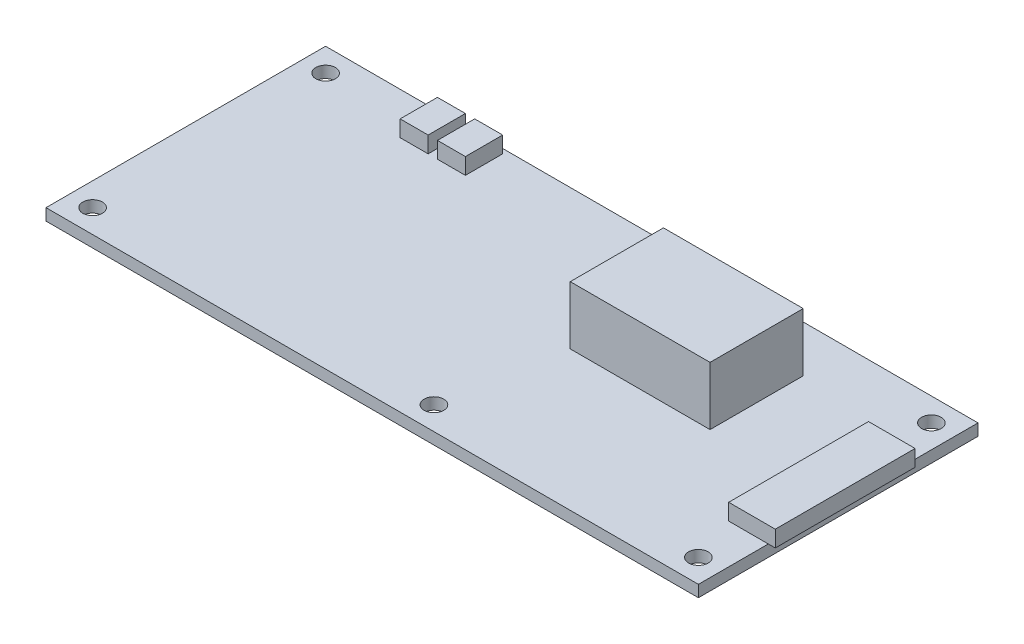
ISO-10303-21;
HEADER;
FILE_DESCRIPTION(('STEP AP214'),'2;1');
FILE_NAME('part.step','',(''),(''),'','','');
FILE_SCHEMA(('AUTOMOTIVE_DESIGN { 1 0 10303 214 1 1 1 1 }'));
ENDSEC;
DATA;
#1=APPLICATION_CONTEXT('core data for automotive mechanical design processes');
#2=APPLICATION_PROTOCOL_DEFINITION('international standard','automotive_design',2000,#1);
#3=PRODUCT_CONTEXT('',#1,'mechanical');
#4=PRODUCT('Part','Part','',(#3));
#5=PRODUCT_RELATED_PRODUCT_CATEGORY('part','',(#4));
#6=PRODUCT_DEFINITION_FORMATION('','',#4);
#7=PRODUCT_DEFINITION_CONTEXT('part definition',#1,'design');
#8=PRODUCT_DEFINITION('design','',#6,#7);
#9=PRODUCT_DEFINITION_SHAPE('','',#8);
#10=(LENGTH_UNIT() NAMED_UNIT(*) SI_UNIT(.MILLI.,.METRE.));
#11=(NAMED_UNIT(*) PLANE_ANGLE_UNIT() SI_UNIT($,.RADIAN.));
#12=(NAMED_UNIT(*) SI_UNIT($,.STERADIAN.) SOLID_ANGLE_UNIT());
#13=UNCERTAINTY_MEASURE_WITH_UNIT(LENGTH_MEASURE(1.E-05),#10,'distance_accuracy_value','');
#14=(GEOMETRIC_REPRESENTATION_CONTEXT(3) GLOBAL_UNCERTAINTY_ASSIGNED_CONTEXT((#13)) GLOBAL_UNIT_ASSIGNED_CONTEXT((#10,
#11,#12)) REPRESENTATION_CONTEXT('',''));
#15=CARTESIAN_POINT('',(0.,0.,0.));
#16=DIRECTION('',(0.,0.,1.));
#17=DIRECTION('',(1.,0.,0.));
#18=AXIS2_PLACEMENT_3D('',#15,#16,#17);
#19=CARTESIAN_POINT('',(0.,2.5,0.));
#20=DIRECTION('',(0.,1.,0.));
#21=DIRECTION('',(0.,0.,1.));
#22=AXIS2_PLACEMENT_3D('',#19,#20,#21);
#23=PLANE('',#22);
#24=CARTESIAN_POINT('',(8.24999999999998,2.5,25.));
#25=DIRECTION('',(0.,1.,0.));
#26=DIRECTION('',(0.,0.,1.));
#27=AXIS2_PLACEMENT_3D('',#24,#25,#26);
#28=CIRCLE('',#27,2.1);
#29=CARTESIAN_POINT('',(8.24999999999998,2.5,27.1));
#30=VERTEX_POINT('',#29);
#31=EDGE_CURVE('E302',#30,#30,#28,.T.);
#32=ORIENTED_EDGE('',*,*,#31,.F.);
#33=EDGE_LOOP('',(#32));
#34=FACE_BOUND('',#33,.T.);
#35=CARTESIAN_POINT('',(65.,2.5,-25.));
#36=DIRECTION('',(0.,1.,0.));
#37=DIRECTION('',(0.,0.,1.));
#38=AXIS2_PLACEMENT_3D('',#35,#36,#37);
#39=CIRCLE('',#38,2.1);
#40=CARTESIAN_POINT('',(65.,2.5,-22.9));
#41=VERTEX_POINT('',#40);
#42=EDGE_CURVE('E314',#41,#41,#39,.T.);
#43=ORIENTED_EDGE('',*,*,#42,.F.);
#44=EDGE_LOOP('',(#43));
#45=FACE_BOUND('',#44,.T.);
#46=CARTESIAN_POINT('',(-65.,2.5,-25.));
#47=DIRECTION('',(0.,1.,0.));
#48=DIRECTION('',(0.,0.,1.));
#49=AXIS2_PLACEMENT_3D('',#46,#47,#48);
#50=CIRCLE('',#49,2.1);
#51=CARTESIAN_POINT('',(-65.,2.5,-22.9));
#52=VERTEX_POINT('',#51);
#53=EDGE_CURVE('E326',#52,#52,#50,.T.);
#54=ORIENTED_EDGE('',*,*,#53,.F.);
#55=EDGE_LOOP('',(#54));
#56=FACE_BOUND('',#55,.T.);
#57=CARTESIAN_POINT('',(8.24999999999998,2.5,-25.));
#58=DIRECTION('',(0.,1.,0.));
#59=DIRECTION('',(0.,0.,1.));
#60=AXIS2_PLACEMENT_3D('',#57,#58,#59);
#61=CIRCLE('',#60,2.1);
#62=CARTESIAN_POINT('',(8.24999999999998,2.5,-22.9));
#63=VERTEX_POINT('',#62);
#64=EDGE_CURVE('E320',#63,#63,#61,.T.);
#65=ORIENTED_EDGE('',*,*,#64,.F.);
#66=EDGE_LOOP('',(#65));
#67=FACE_BOUND('',#66,.T.);
#68=CARTESIAN_POINT('',(-65.,2.5,25.));
#69=DIRECTION('',(0.,1.,0.));
#70=DIRECTION('',(0.,0.,1.));
#71=AXIS2_PLACEMENT_3D('',#68,#69,#70);
#72=CIRCLE('',#71,2.1);
#73=CARTESIAN_POINT('',(-65.,2.5,27.1));
#74=VERTEX_POINT('',#73);
#75=EDGE_CURVE('E308',#74,#74,#72,.T.);
#76=ORIENTED_EDGE('',*,*,#75,.F.);
#77=EDGE_LOOP('',(#76));
#78=FACE_BOUND('',#77,.T.);
#79=CARTESIAN_POINT('',(65.,2.5,25.));
#80=DIRECTION('',(0.,1.,0.));
#81=DIRECTION('',(0.,0.,1.));
#82=AXIS2_PLACEMENT_3D('',#79,#80,#81);
#83=CIRCLE('',#82,2.1);
#84=CARTESIAN_POINT('',(65.,2.5,27.1));
#85=VERTEX_POINT('',#84);
#86=EDGE_CURVE('E296',#85,#85,#83,.T.);
#87=ORIENTED_EDGE('',*,*,#86,.F.);
#88=EDGE_LOOP('',(#87));
#89=FACE_BOUND('',#88,.T.);
#90=DIRECTION('',(1.,0.,0.));
#91=VECTOR('',#90,1.);
#92=CARTESIAN_POINT('',(-45.,2.5,-21.));
#93=LINE('',#92,#91);
#94=CARTESIAN_POINT('',(-45.,2.5,-21.));
#95=VERTEX_POINT('',#94);
#96=CARTESIAN_POINT('',(-39.,2.5,-21.));
#97=VERTEX_POINT('',#96);
#98=EDGE_CURVE('E280',#95,#97,#93,.T.);
#99=ORIENTED_EDGE('',*,*,#98,.F.);
#100=DIRECTION('',(0.,0.,1.));
#101=VECTOR('',#100,1.);
#102=CARTESIAN_POINT('',(-45.,2.5,-29.));
#103=LINE('',#102,#101);
#104=CARTESIAN_POINT('',(-45.,2.5,-29.));
#105=VERTEX_POINT('',#104);
#106=EDGE_CURVE('E266',#105,#95,#103,.T.);
#107=ORIENTED_EDGE('',*,*,#106,.F.);
#108=DIRECTION('',(-1.,0.,0.));
#109=VECTOR('',#108,1.);
#110=CARTESIAN_POINT('',(-45.,2.5,-29.));
#111=LINE('',#110,#109);
#112=CARTESIAN_POINT('',(-39.,2.5,-29.));
#113=VERTEX_POINT('',#112);
#114=EDGE_CURVE('E271',#113,#105,#111,.T.);
#115=ORIENTED_EDGE('',*,*,#114,.F.);
#116=DIRECTION('',(0.,0.,-1.));
#117=VECTOR('',#116,1.);
#118=CARTESIAN_POINT('',(-39.,2.5,-29.));
#119=LINE('',#118,#117);
#120=EDGE_CURVE('E282',#97,#113,#119,.T.);
#121=ORIENTED_EDGE('',*,*,#120,.F.);
#122=EDGE_LOOP('',(#99,#107,#115,#121));
#123=FACE_BOUND('',#122,.T.);
#124=DIRECTION('',(1.,0.,0.));
#125=VECTOR('',#124,1.);
#126=CARTESIAN_POINT('',(-37.,2.5,-21.));
#127=LINE('',#126,#125);
#128=CARTESIAN_POINT('',(-37.,2.5,-21.));
#129=VERTEX_POINT('',#128);
#130=CARTESIAN_POINT('',(-31.,2.5,-21.));
#131=VERTEX_POINT('',#130);
#132=EDGE_CURVE('E251',#129,#131,#127,.T.);
#133=ORIENTED_EDGE('',*,*,#132,.F.);
#134=DIRECTION('',(0.,0.,1.));
#135=VECTOR('',#134,1.);
#136=CARTESIAN_POINT('',(-37.,2.5,-29.));
#137=LINE('',#136,#135);
#138=CARTESIAN_POINT('',(-37.,2.5,-29.));
#139=VERTEX_POINT('',#138);
#140=EDGE_CURVE('E237',#139,#129,#137,.T.);
#141=ORIENTED_EDGE('',*,*,#140,.F.);
#142=DIRECTION('',(-1.,0.,0.));
#143=VECTOR('',#142,1.);
#144=CARTESIAN_POINT('',(-37.,2.5,-29.));
#145=LINE('',#144,#143);
#146=CARTESIAN_POINT('',(-31.,2.5,-29.));
#147=VERTEX_POINT('',#146);
#148=EDGE_CURVE('E242',#147,#139,#145,.T.);
#149=ORIENTED_EDGE('',*,*,#148,.F.);
#150=DIRECTION('',(0.,0.,-1.));
#151=VECTOR('',#150,1.);
#152=CARTESIAN_POINT('',(-31.,2.5,-29.));
#153=LINE('',#152,#151);
#154=EDGE_CURVE('E253',#131,#147,#153,.T.);
#155=ORIENTED_EDGE('',*,*,#154,.F.);
#156=EDGE_LOOP('',(#133,#141,#149,#155));
#157=FACE_BOUND('',#156,.T.);
#158=DIRECTION('',(0.,0.,-1.));
#159=VECTOR('',#158,1.);
#160=CARTESIAN_POINT('',(70.,2.5,-30.));
#161=LINE('',#160,#159);
#162=CARTESIAN_POINT('',(70.,2.5,30.));
#163=VERTEX_POINT('',#162);
#164=CARTESIAN_POINT('',(70.,2.5,15.));
#165=VERTEX_POINT('',#164);
#166=EDGE_CURVE('E332',#163,#165,#161,.T.);
#167=ORIENTED_EDGE('',*,*,#166,.T.);
#168=DIRECTION('',(1.,0.,0.));
#169=VECTOR('',#168,1.);
#170=CARTESIAN_POINT('',(61.5,2.5,15.));
#171=LINE('',#170,#169);
#172=CARTESIAN_POINT('',(61.5,2.5,15.));
#173=VERTEX_POINT('',#172);
#174=EDGE_CURVE('E56',#173,#165,#171,.T.);
#175=ORIENTED_EDGE('',*,*,#174,.F.);
#176=DIRECTION('',(0.,0.,1.));
#177=VECTOR('',#176,1.);
#178=CARTESIAN_POINT('',(61.5,2.5,-15.));
#179=LINE('',#178,#177);
#180=CARTESIAN_POINT('',(61.5,2.5,-15.));
#181=VERTEX_POINT('',#180);
#182=EDGE_CURVE('E202',#181,#173,#179,.T.);
#183=ORIENTED_EDGE('',*,*,#182,.F.);
#184=DIRECTION('',(-1.,0.,0.));
#185=VECTOR('',#184,1.);
#186=CARTESIAN_POINT('',(61.5,2.5,-15.));
#187=LINE('',#186,#185);
#188=CARTESIAN_POINT('',(70.,2.5,-15.));
#189=VERTEX_POINT('',#188);
#190=EDGE_CURVE('E224',#189,#181,#187,.T.);
#191=ORIENTED_EDGE('',*,*,#190,.F.);
#192=CARTESIAN_POINT('',(70.,2.5,-30.));
#193=VERTEX_POINT('',#192);
#194=EDGE_CURVE('E336',#189,#193,#161,.T.);
#195=ORIENTED_EDGE('',*,*,#194,.T.);
#196=DIRECTION('',(-1.,0.,0.));
#197=VECTOR('',#196,1.);
#198=CARTESIAN_POINT('',(-70.,2.5,-30.));
#199=LINE('',#198,#197);
#200=CARTESIAN_POINT('',(-70.,2.5,-30.));
#201=VERTEX_POINT('',#200);
#202=EDGE_CURVE('E334',#193,#201,#199,.T.);
#203=ORIENTED_EDGE('',*,*,#202,.T.);
#204=DIRECTION('',(0.,0.,1.));
#205=VECTOR('',#204,1.);
#206=CARTESIAN_POINT('',(-70.,2.5,-30.));
#207=LINE('',#206,#205);
#208=CARTESIAN_POINT('',(-70.,2.5,30.));
#209=VERTEX_POINT('',#208);
#210=EDGE_CURVE('E338',#201,#209,#207,.T.);
#211=ORIENTED_EDGE('',*,*,#210,.T.);
#212=DIRECTION('',(1.,0.,0.));
#213=VECTOR('',#212,1.);
#214=CARTESIAN_POINT('',(-70.,2.5,30.));
#215=LINE('',#214,#213);
#216=EDGE_CURVE('E340',#209,#163,#215,.T.);
#217=ORIENTED_EDGE('',*,*,#216,.T.);
#218=EDGE_LOOP('',(#167,#175,#183,#191,#195,#203,#211,#217));
#219=FACE_BOUND('',#218,.T.);
#220=DIRECTION('',(1.,0.,0.));
#221=VECTOR('',#220,1.);
#222=CARTESIAN_POINT('',(12.5,2.5,0.));
#223=LINE('',#222,#221);
#224=CARTESIAN_POINT('',(12.5,2.5,0.));
#225=VERTEX_POINT('',#224);
#226=CARTESIAN_POINT('',(42.5,2.5,0.));
#227=VERTEX_POINT('',#226);
#228=EDGE_CURVE('E679',#225,#227,#223,.T.);
#229=ORIENTED_EDGE('',*,*,#228,.F.);
#230=DIRECTION('',(0.,0.,1.));
#231=VECTOR('',#230,1.);
#232=CARTESIAN_POINT('',(12.5,2.5,-20.));
#233=LINE('',#232,#231);
#234=CARTESIAN_POINT('',(12.5,2.5,-20.));
#235=VERTEX_POINT('',#234);
#236=EDGE_CURVE('E200',#235,#225,#233,.T.);
#237=ORIENTED_EDGE('',*,*,#236,.F.);
#238=DIRECTION('',(-1.,0.,0.));
#239=VECTOR('',#238,1.);
#240=CARTESIAN_POINT('',(12.5,2.5,-20.));
#241=LINE('',#240,#239);
#242=CARTESIAN_POINT('',(42.5,2.5,-20.));
#243=VERTEX_POINT('',#242);
#244=EDGE_CURVE('E196',#243,#235,#241,.T.);
#245=ORIENTED_EDGE('',*,*,#244,.F.);
#246=DIRECTION('',(0.,0.,-1.));
#247=VECTOR('',#246,1.);
#248=CARTESIAN_POINT('',(42.5,2.5,-20.));
#249=LINE('',#248,#247);
#250=EDGE_CURVE('E676',#227,#243,#249,.T.);
#251=ORIENTED_EDGE('',*,*,#250,.F.);
#252=EDGE_LOOP('',(#229,#237,#245,#251));
#253=FACE_BOUND('',#252,.T.);
#254=ADVANCED_FACE('F33',(#34,#45,#56,#67,#78,#89,#123,#157,#219,#253),#23,.T.);
#255=CARTESIAN_POINT('',(0.,0.,0.));
#256=DIRECTION('',(0.,1.,0.));
#257=DIRECTION('',(0.,0.,1.));
#258=AXIS2_PLACEMENT_3D('',#255,#256,#257);
#259=PLANE('',#258);
#260=DIRECTION('',(0.,0.,-1.));
#261=VECTOR('',#260,1.);
#262=CARTESIAN_POINT('',(70.,0.,-30.));
#263=LINE('',#262,#261);
#264=CARTESIAN_POINT('',(70.,0.,30.));
#265=VERTEX_POINT('',#264);
#266=CARTESIAN_POINT('',(70.,0.,-30.));
#267=VERTEX_POINT('',#266);
#268=EDGE_CURVE('E329',#265,#267,#263,.T.);
#269=ORIENTED_EDGE('',*,*,#268,.F.);
#270=DIRECTION('',(1.,0.,0.));
#271=VECTOR('',#270,1.);
#272=CARTESIAN_POINT('',(-70.,0.,30.));
#273=LINE('',#272,#271);
#274=CARTESIAN_POINT('',(-70.,0.,30.));
#275=VERTEX_POINT('',#274);
#276=EDGE_CURVE('E349',#275,#265,#273,.T.);
#277=ORIENTED_EDGE('',*,*,#276,.F.);
#278=DIRECTION('',(0.,0.,1.));
#279=VECTOR('',#278,1.);
#280=CARTESIAN_POINT('',(-70.,0.,-30.));
#281=LINE('',#280,#279);
#282=CARTESIAN_POINT('',(-70.,0.,-30.));
#283=VERTEX_POINT('',#282);
#284=EDGE_CURVE('E347',#283,#275,#281,.T.);
#285=ORIENTED_EDGE('',*,*,#284,.F.);
#286=DIRECTION('',(-1.,0.,0.));
#287=VECTOR('',#286,1.);
#288=CARTESIAN_POINT('',(-70.,0.,-30.));
#289=LINE('',#288,#287);
#290=EDGE_CURVE('E345',#267,#283,#289,.T.);
#291=ORIENTED_EDGE('',*,*,#290,.F.);
#292=EDGE_LOOP('',(#269,#277,#285,#291));
#293=FACE_BOUND('',#292,.T.);
#294=CARTESIAN_POINT('',(-65.,0.,-25.));
#295=DIRECTION('',(0.,1.,0.));
#296=DIRECTION('',(0.,0.,1.));
#297=AXIS2_PLACEMENT_3D('',#294,#295,#296);
#298=CIRCLE('',#297,2.1);
#299=CARTESIAN_POINT('',(-65.,0.,-22.9));
#300=VERTEX_POINT('',#299);
#301=EDGE_CURVE('E323',#300,#300,#298,.T.);
#302=ORIENTED_EDGE('',*,*,#301,.T.);
#303=EDGE_LOOP('',(#302));
#304=FACE_BOUND('',#303,.T.);
#305=CARTESIAN_POINT('',(8.24999999999998,0.,-25.));
#306=DIRECTION('',(0.,1.,0.));
#307=DIRECTION('',(0.,0.,1.));
#308=AXIS2_PLACEMENT_3D('',#305,#306,#307);
#309=CIRCLE('',#308,2.1);
#310=CARTESIAN_POINT('',(8.24999999999998,0.,-22.9));
#311=VERTEX_POINT('',#310);
#312=EDGE_CURVE('E317',#311,#311,#309,.T.);
#313=ORIENTED_EDGE('',*,*,#312,.T.);
#314=EDGE_LOOP('',(#313));
#315=FACE_BOUND('',#314,.T.);
#316=CARTESIAN_POINT('',(65.,0.,-25.));
#317=DIRECTION('',(0.,1.,0.));
#318=DIRECTION('',(0.,0.,1.));
#319=AXIS2_PLACEMENT_3D('',#316,#317,#318);
#320=CIRCLE('',#319,2.1);
#321=CARTESIAN_POINT('',(65.,0.,-22.9));
#322=VERTEX_POINT('',#321);
#323=EDGE_CURVE('E311',#322,#322,#320,.T.);
#324=ORIENTED_EDGE('',*,*,#323,.T.);
#325=EDGE_LOOP('',(#324));
#326=FACE_BOUND('',#325,.T.);
#327=CARTESIAN_POINT('',(-65.,0.,25.));
#328=DIRECTION('',(0.,1.,0.));
#329=DIRECTION('',(0.,0.,1.));
#330=AXIS2_PLACEMENT_3D('',#327,#328,#329);
#331=CIRCLE('',#330,2.1);
#332=CARTESIAN_POINT('',(-65.,0.,27.1));
#333=VERTEX_POINT('',#332);
#334=EDGE_CURVE('E305',#333,#333,#331,.T.);
#335=ORIENTED_EDGE('',*,*,#334,.T.);
#336=EDGE_LOOP('',(#335));
#337=FACE_BOUND('',#336,.T.);
#338=CARTESIAN_POINT('',(8.24999999999998,0.,25.));
#339=DIRECTION('',(0.,1.,0.));
#340=DIRECTION('',(0.,0.,1.));
#341=AXIS2_PLACEMENT_3D('',#338,#339,#340);
#342=CIRCLE('',#341,2.1);
#343=CARTESIAN_POINT('',(8.24999999999998,0.,27.1));
#344=VERTEX_POINT('',#343);
#345=EDGE_CURVE('E299',#344,#344,#342,.T.);
#346=ORIENTED_EDGE('',*,*,#345,.T.);
#347=EDGE_LOOP('',(#346));
#348=FACE_BOUND('',#347,.T.);
#349=CARTESIAN_POINT('',(65.,0.,25.));
#350=DIRECTION('',(0.,1.,0.));
#351=DIRECTION('',(0.,0.,1.));
#352=AXIS2_PLACEMENT_3D('',#349,#350,#351);
#353=CIRCLE('',#352,2.1);
#354=CARTESIAN_POINT('',(65.,0.,27.1));
#355=VERTEX_POINT('',#354);
#356=EDGE_CURVE('E295',#355,#355,#353,.T.);
#357=ORIENTED_EDGE('',*,*,#356,.T.);
#358=EDGE_LOOP('',(#357));
#359=FACE_BOUND('',#358,.T.);
#360=ADVANCED_FACE('F367',(#293,#304,#315,#326,#337,#348,#359),#259,.F.);
#361=CARTESIAN_POINT('',(70.,2.5,-30.));
#362=DIRECTION('',(-1.,0.,0.));
#363=DIRECTION('',(0.,0.,1.));
#364=AXIS2_PLACEMENT_3D('',#361,#362,#363);
#365=PLANE('',#364);
#366=ORIENTED_EDGE('',*,*,#268,.T.);
#367=DIRECTION('',(0.,-1.,0.));
#368=VECTOR('',#367,1.);
#369=CARTESIAN_POINT('',(70.,2.5,-30.));
#370=LINE('',#369,#368);
#371=EDGE_CURVE('E11',#193,#267,#370,.T.);
#372=ORIENTED_EDGE('',*,*,#371,.F.);
#373=ORIENTED_EDGE('',*,*,#194,.F.);
#374=EDGE_CURVE('E335',#165,#189,#161,.T.);
#375=ORIENTED_EDGE('',*,*,#374,.F.);
#376=ORIENTED_EDGE('',*,*,#166,.F.);
#377=DIRECTION('',(0.,-1.,0.));
#378=VECTOR('',#377,1.);
#379=CARTESIAN_POINT('',(70.,2.5,30.));
#380=LINE('',#379,#378);
#381=EDGE_CURVE('E342',#163,#265,#380,.T.);
#382=ORIENTED_EDGE('',*,*,#381,.T.);
#383=EDGE_LOOP('',(#366,#372,#373,#375,#376,#382));
#384=FACE_BOUND('',#383,.T.);
#385=ADVANCED_FACE('F35',(#384),#365,.F.);
#386=CARTESIAN_POINT('',(-70.,2.5,-30.));
#387=DIRECTION('',(0.,0.,1.));
#388=DIRECTION('',(1.,0.,0.));
#389=AXIS2_PLACEMENT_3D('',#386,#387,#388);
#390=PLANE('',#389);
#391=ORIENTED_EDGE('',*,*,#290,.T.);
#392=DIRECTION('',(0.,-1.,0.));
#393=VECTOR('',#392,1.);
#394=CARTESIAN_POINT('',(-70.,2.5,-30.));
#395=LINE('',#394,#393);
#396=EDGE_CURVE('E41',#201,#283,#395,.T.);
#397=ORIENTED_EDGE('',*,*,#396,.F.);
#398=ORIENTED_EDGE('',*,*,#202,.F.);
#399=ORIENTED_EDGE('',*,*,#371,.T.);
#400=EDGE_LOOP('',(#391,#397,#398,#399));
#401=FACE_BOUND('',#400,.T.);
#402=ADVANCED_FACE('F427',(#401),#390,.F.);
#403=CARTESIAN_POINT('',(-70.,2.5,-30.));
#404=DIRECTION('',(1.,0.,0.));
#405=DIRECTION('',(0.,0.,-1.));
#406=AXIS2_PLACEMENT_3D('',#403,#404,#405);
#407=PLANE('',#406);
#408=ORIENTED_EDGE('',*,*,#284,.T.);
#409=DIRECTION('',(0.,-1.,0.));
#410=VECTOR('',#409,1.);
#411=CARTESIAN_POINT('',(-70.,2.5,30.));
#412=LINE('',#411,#410);
#413=EDGE_CURVE('E353',#209,#275,#412,.T.);
#414=ORIENTED_EDGE('',*,*,#413,.F.);
#415=ORIENTED_EDGE('',*,*,#210,.F.);
#416=ORIENTED_EDGE('',*,*,#396,.T.);
#417=EDGE_LOOP('',(#408,#414,#415,#416));
#418=FACE_BOUND('',#417,.T.);
#419=ADVANCED_FACE('F360',(#418),#407,.F.);
#420=CARTESIAN_POINT('',(-70.,2.5,30.));
#421=DIRECTION('',(0.,0.,-1.));
#422=DIRECTION('',(-1.,0.,0.));
#423=AXIS2_PLACEMENT_3D('',#420,#421,#422);
#424=PLANE('',#423);
#425=ORIENTED_EDGE('',*,*,#276,.T.);
#426=ORIENTED_EDGE('',*,*,#381,.F.);
#427=ORIENTED_EDGE('',*,*,#216,.F.);
#428=ORIENTED_EDGE('',*,*,#413,.T.);
#429=EDGE_LOOP('',(#425,#426,#427,#428));
#430=FACE_BOUND('',#429,.T.);
#431=ADVANCED_FACE('F371',(#430),#424,.F.);
#432=CARTESIAN_POINT('',(-65.,2.5,-25.));
#433=DIRECTION('',(0.,-1.,0.));
#434=DIRECTION('',(0.,0.,-1.));
#435=AXIS2_PLACEMENT_3D('',#432,#433,#434);
#436=CYLINDRICAL_SURFACE('',#435,2.1);
#437=ORIENTED_EDGE('',*,*,#53,.T.);
#438=EDGE_LOOP('',(#437));
#439=FACE_BOUND('',#438,.T.);
#440=ORIENTED_EDGE('',*,*,#301,.F.);
#441=EDGE_LOOP('',(#440));
#442=FACE_BOUND('',#441,.T.);
#443=ADVANCED_FACE('F421',(#439,#442),#436,.F.);
#444=CARTESIAN_POINT('',(8.24999999999998,2.5,-25.));
#445=DIRECTION('',(0.,-1.,0.));
#446=DIRECTION('',(0.,0.,-1.));
#447=AXIS2_PLACEMENT_3D('',#444,#445,#446);
#448=CYLINDRICAL_SURFACE('',#447,2.1);
#449=ORIENTED_EDGE('',*,*,#64,.T.);
#450=EDGE_LOOP('',(#449));
#451=FACE_BOUND('',#450,.T.);
#452=ORIENTED_EDGE('',*,*,#312,.F.);
#453=EDGE_LOOP('',(#452));
#454=FACE_BOUND('',#453,.T.);
#455=ADVANCED_FACE('F465',(#451,#454),#448,.F.);
#456=CARTESIAN_POINT('',(65.,2.5,-25.));
#457=DIRECTION('',(0.,-1.,0.));
#458=DIRECTION('',(0.,0.,-1.));
#459=AXIS2_PLACEMENT_3D('',#456,#457,#458);
#460=CYLINDRICAL_SURFACE('',#459,2.1);
#461=ORIENTED_EDGE('',*,*,#42,.T.);
#462=EDGE_LOOP('',(#461));
#463=FACE_BOUND('',#462,.T.);
#464=ORIENTED_EDGE('',*,*,#323,.F.);
#465=EDGE_LOOP('',(#464));
#466=FACE_BOUND('',#465,.T.);
#467=ADVANCED_FACE('F474',(#463,#466),#460,.F.);
#468=CARTESIAN_POINT('',(-65.,2.5,25.));
#469=DIRECTION('',(0.,-1.,0.));
#470=DIRECTION('',(0.,0.,-1.));
#471=AXIS2_PLACEMENT_3D('',#468,#469,#470);
#472=CYLINDRICAL_SURFACE('',#471,2.1);
#473=ORIENTED_EDGE('',*,*,#75,.T.);
#474=EDGE_LOOP('',(#473));
#475=FACE_BOUND('',#474,.T.);
#476=ORIENTED_EDGE('',*,*,#334,.F.);
#477=EDGE_LOOP('',(#476));
#478=FACE_BOUND('',#477,.T.);
#479=ADVANCED_FACE('F483',(#475,#478),#472,.F.);
#480=CARTESIAN_POINT('',(8.24999999999998,2.5,25.));
#481=DIRECTION('',(0.,-1.,0.));
#482=DIRECTION('',(0.,0.,-1.));
#483=AXIS2_PLACEMENT_3D('',#480,#481,#482);
#484=CYLINDRICAL_SURFACE('',#483,2.1);
#485=ORIENTED_EDGE('',*,*,#31,.T.);
#486=EDGE_LOOP('',(#485));
#487=FACE_BOUND('',#486,.T.);
#488=ORIENTED_EDGE('',*,*,#345,.F.);
#489=EDGE_LOOP('',(#488));
#490=FACE_BOUND('',#489,.T.);
#491=ADVANCED_FACE('F493',(#487,#490),#484,.F.);
#492=CARTESIAN_POINT('',(65.,2.5,25.));
#493=DIRECTION('',(0.,-1.,0.));
#494=DIRECTION('',(0.,0.,-1.));
#495=AXIS2_PLACEMENT_3D('',#492,#493,#494);
#496=CYLINDRICAL_SURFACE('',#495,2.1);
#497=ORIENTED_EDGE('',*,*,#86,.T.);
#498=EDGE_LOOP('',(#497));
#499=FACE_BOUND('',#498,.T.);
#500=ORIENTED_EDGE('',*,*,#356,.F.);
#501=EDGE_LOOP('',(#500));
#502=FACE_BOUND('',#501,.T.);
#503=ADVANCED_FACE('F502',(#499,#502),#496,.F.);
#504=CARTESIAN_POINT('',(-45.,6.,-29.));
#505=DIRECTION('',(1.,0.,0.));
#506=DIRECTION('',(0.,0.,-1.));
#507=AXIS2_PLACEMENT_3D('',#504,#505,#506);
#508=PLANE('',#507);
#509=ORIENTED_EDGE('',*,*,#106,.T.);
#510=DIRECTION('',(0.,-1.,0.));
#511=VECTOR('',#510,1.);
#512=CARTESIAN_POINT('',(-45.,6.,-21.));
#513=LINE('',#512,#511);
#514=CARTESIAN_POINT('',(-45.,6.,-21.));
#515=VERTEX_POINT('',#514);
#516=EDGE_CURVE('E293',#515,#95,#513,.T.);
#517=ORIENTED_EDGE('',*,*,#516,.F.);
#518=DIRECTION('',(0.,0.,1.));
#519=VECTOR('',#518,1.);
#520=CARTESIAN_POINT('',(-45.,6.,-29.));
#521=LINE('',#520,#519);
#522=CARTESIAN_POINT('',(-45.,6.,-29.));
#523=VERTEX_POINT('',#522);
#524=EDGE_CURVE('E267',#523,#515,#521,.T.);
#525=ORIENTED_EDGE('',*,*,#524,.F.);
#526=DIRECTION('',(0.,-1.,0.));
#527=VECTOR('',#526,1.);
#528=CARTESIAN_POINT('',(-45.,6.,-29.));
#529=LINE('',#528,#527);
#530=EDGE_CURVE('E277',#523,#105,#529,.T.);
#531=ORIENTED_EDGE('',*,*,#530,.T.);
#532=EDGE_LOOP('',(#509,#517,#525,#531));
#533=FACE_BOUND('',#532,.T.);
#534=ADVANCED_FACE('F511',(#533),#508,.F.);
#535=CARTESIAN_POINT('',(-45.,6.,-21.));
#536=DIRECTION('',(0.,0.,-1.));
#537=DIRECTION('',(-1.,0.,0.));
#538=AXIS2_PLACEMENT_3D('',#535,#536,#537);
#539=PLANE('',#538);
#540=ORIENTED_EDGE('',*,*,#98,.T.);
#541=DIRECTION('',(0.,-1.,0.));
#542=VECTOR('',#541,1.);
#543=CARTESIAN_POINT('',(-39.,6.,-21.));
#544=LINE('',#543,#542);
#545=CARTESIAN_POINT('',(-39.,6.,-21.));
#546=VERTEX_POINT('',#545);
#547=EDGE_CURVE('E290',#546,#97,#544,.T.);
#548=ORIENTED_EDGE('',*,*,#547,.F.);
#549=DIRECTION('',(1.,0.,0.));
#550=VECTOR('',#549,1.);
#551=CARTESIAN_POINT('',(-45.,6.,-21.));
#552=LINE('',#551,#550);
#553=EDGE_CURVE('E270',#515,#546,#552,.T.);
#554=ORIENTED_EDGE('',*,*,#553,.F.);
#555=ORIENTED_EDGE('',*,*,#516,.T.);
#556=EDGE_LOOP('',(#540,#548,#554,#555));
#557=FACE_BOUND('',#556,.T.);
#558=ADVANCED_FACE('F521',(#557),#539,.F.);
#559=CARTESIAN_POINT('',(-39.,6.,-29.));
#560=DIRECTION('',(-1.,0.,0.));
#561=DIRECTION('',(0.,0.,1.));
#562=AXIS2_PLACEMENT_3D('',#559,#560,#561);
#563=PLANE('',#562);
#564=ORIENTED_EDGE('',*,*,#120,.T.);
#565=DIRECTION('',(0.,-1.,0.));
#566=VECTOR('',#565,1.);
#567=CARTESIAN_POINT('',(-39.,6.,-29.));
#568=LINE('',#567,#566);
#569=CARTESIAN_POINT('',(-39.,6.,-29.));
#570=VERTEX_POINT('',#569);
#571=EDGE_CURVE('E288',#570,#113,#568,.T.);
#572=ORIENTED_EDGE('',*,*,#571,.F.);
#573=DIRECTION('',(0.,0.,-1.));
#574=VECTOR('',#573,1.);
#575=CARTESIAN_POINT('',(-39.,6.,-29.));
#576=LINE('',#575,#574);
#577=EDGE_CURVE('E273',#546,#570,#576,.T.);
#578=ORIENTED_EDGE('',*,*,#577,.F.);
#579=ORIENTED_EDGE('',*,*,#547,.T.);
#580=EDGE_LOOP('',(#564,#572,#578,#579));
#581=FACE_BOUND('',#580,.T.);
#582=ADVANCED_FACE('F528',(#581),#563,.F.);
#583=CARTESIAN_POINT('',(-45.,6.,-29.));
#584=DIRECTION('',(0.,0.,1.));
#585=DIRECTION('',(1.,0.,0.));
#586=AXIS2_PLACEMENT_3D('',#583,#584,#585);
#587=PLANE('',#586);
#588=ORIENTED_EDGE('',*,*,#114,.T.);
#589=ORIENTED_EDGE('',*,*,#530,.F.);
#590=DIRECTION('',(-1.,0.,0.));
#591=VECTOR('',#590,1.);
#592=CARTESIAN_POINT('',(-45.,6.,-29.));
#593=LINE('',#592,#591);
#594=EDGE_CURVE('E275',#570,#523,#593,.T.);
#595=ORIENTED_EDGE('',*,*,#594,.F.);
#596=ORIENTED_EDGE('',*,*,#571,.T.);
#597=EDGE_LOOP('',(#588,#589,#595,#596));
#598=FACE_BOUND('',#597,.T.);
#599=ADVANCED_FACE('F536',(#598),#587,.F.);
#600=CARTESIAN_POINT('',(0.,6.,0.));
#601=DIRECTION('',(0.,1.,0.));
#602=DIRECTION('',(0.,0.,1.));
#603=AXIS2_PLACEMENT_3D('',#600,#601,#602);
#604=PLANE('',#603);
#605=ORIENTED_EDGE('',*,*,#524,.T.);
#606=ORIENTED_EDGE('',*,*,#553,.T.);
#607=ORIENTED_EDGE('',*,*,#577,.T.);
#608=ORIENTED_EDGE('',*,*,#594,.T.);
#609=EDGE_LOOP('',(#605,#606,#607,#608));
#610=FACE_BOUND('',#609,.T.);
#611=ADVANCED_FACE('F544',(#610),#604,.T.);
#612=CARTESIAN_POINT('',(-37.,6.,-29.));
#613=DIRECTION('',(1.,0.,0.));
#614=DIRECTION('',(0.,0.,-1.));
#615=AXIS2_PLACEMENT_3D('',#612,#613,#614);
#616=PLANE('',#615);
#617=ORIENTED_EDGE('',*,*,#140,.T.);
#618=DIRECTION('',(0.,-1.,0.));
#619=VECTOR('',#618,1.);
#620=CARTESIAN_POINT('',(-37.,6.,-21.));
#621=LINE('',#620,#619);
#622=CARTESIAN_POINT('',(-37.,6.,-21.));
#623=VERTEX_POINT('',#622);
#624=EDGE_CURVE('E264',#623,#129,#621,.T.);
#625=ORIENTED_EDGE('',*,*,#624,.F.);
#626=DIRECTION('',(0.,0.,1.));
#627=VECTOR('',#626,1.);
#628=CARTESIAN_POINT('',(-37.,6.,-29.));
#629=LINE('',#628,#627);
#630=CARTESIAN_POINT('',(-37.,6.,-29.));
#631=VERTEX_POINT('',#630);
#632=EDGE_CURVE('E238',#631,#623,#629,.T.);
#633=ORIENTED_EDGE('',*,*,#632,.F.);
#634=DIRECTION('',(0.,-1.,0.));
#635=VECTOR('',#634,1.);
#636=CARTESIAN_POINT('',(-37.,6.,-29.));
#637=LINE('',#636,#635);
#638=EDGE_CURVE('E248',#631,#139,#637,.T.);
#639=ORIENTED_EDGE('',*,*,#638,.T.);
#640=EDGE_LOOP('',(#617,#625,#633,#639));
#641=FACE_BOUND('',#640,.T.);
#642=ADVANCED_FACE('F552',(#641),#616,.F.);
#643=CARTESIAN_POINT('',(-37.,6.,-21.));
#644=DIRECTION('',(0.,0.,-1.));
#645=DIRECTION('',(-1.,0.,0.));
#646=AXIS2_PLACEMENT_3D('',#643,#644,#645);
#647=PLANE('',#646);
#648=ORIENTED_EDGE('',*,*,#132,.T.);
#649=DIRECTION('',(0.,-1.,0.));
#650=VECTOR('',#649,1.);
#651=CARTESIAN_POINT('',(-31.,6.,-21.));
#652=LINE('',#651,#650);
#653=CARTESIAN_POINT('',(-31.,6.,-21.));
#654=VERTEX_POINT('',#653);
#655=EDGE_CURVE('E261',#654,#131,#652,.T.);
#656=ORIENTED_EDGE('',*,*,#655,.F.);
#657=DIRECTION('',(1.,0.,0.));
#658=VECTOR('',#657,1.);
#659=CARTESIAN_POINT('',(-37.,6.,-21.));
#660=LINE('',#659,#658);
#661=EDGE_CURVE('E241',#623,#654,#660,.T.);
#662=ORIENTED_EDGE('',*,*,#661,.F.);
#663=ORIENTED_EDGE('',*,*,#624,.T.);
#664=EDGE_LOOP('',(#648,#656,#662,#663));
#665=FACE_BOUND('',#664,.T.);
#666=ADVANCED_FACE('F560',(#665),#647,.F.);
#667=CARTESIAN_POINT('',(-31.,6.,-29.));
#668=DIRECTION('',(-1.,0.,0.));
#669=DIRECTION('',(0.,0.,1.));
#670=AXIS2_PLACEMENT_3D('',#667,#668,#669);
#671=PLANE('',#670);
#672=ORIENTED_EDGE('',*,*,#154,.T.);
#673=DIRECTION('',(0.,-1.,0.));
#674=VECTOR('',#673,1.);
#675=CARTESIAN_POINT('',(-31.,6.,-29.));
#676=LINE('',#675,#674);
#677=CARTESIAN_POINT('',(-31.,6.,-29.));
#678=VERTEX_POINT('',#677);
#679=EDGE_CURVE('E259',#678,#147,#676,.T.);
#680=ORIENTED_EDGE('',*,*,#679,.F.);
#681=DIRECTION('',(0.,0.,-1.));
#682=VECTOR('',#681,1.);
#683=CARTESIAN_POINT('',(-31.,6.,-29.));
#684=LINE('',#683,#682);
#685=EDGE_CURVE('E244',#654,#678,#684,.T.);
#686=ORIENTED_EDGE('',*,*,#685,.F.);
#687=ORIENTED_EDGE('',*,*,#655,.T.);
#688=EDGE_LOOP('',(#672,#680,#686,#687));
#689=FACE_BOUND('',#688,.T.);
#690=ADVANCED_FACE('F568',(#689),#671,.F.);
#691=CARTESIAN_POINT('',(-37.,6.,-29.));
#692=DIRECTION('',(0.,0.,1.));
#693=DIRECTION('',(1.,0.,0.));
#694=AXIS2_PLACEMENT_3D('',#691,#692,#693);
#695=PLANE('',#694);
#696=ORIENTED_EDGE('',*,*,#148,.T.);
#697=ORIENTED_EDGE('',*,*,#638,.F.);
#698=DIRECTION('',(-1.,0.,0.));
#699=VECTOR('',#698,1.);
#700=CARTESIAN_POINT('',(-37.,6.,-29.));
#701=LINE('',#700,#699);
#702=EDGE_CURVE('E246',#678,#631,#701,.T.);
#703=ORIENTED_EDGE('',*,*,#702,.F.);
#704=ORIENTED_EDGE('',*,*,#679,.T.);
#705=EDGE_LOOP('',(#696,#697,#703,#704));
#706=FACE_BOUND('',#705,.T.);
#707=ADVANCED_FACE('F576',(#706),#695,.F.);
#708=CARTESIAN_POINT('',(0.,6.,0.));
#709=DIRECTION('',(0.,1.,0.));
#710=DIRECTION('',(0.,0.,1.));
#711=AXIS2_PLACEMENT_3D('',#708,#709,#710);
#712=PLANE('',#711);
#713=ORIENTED_EDGE('',*,*,#632,.T.);
#714=ORIENTED_EDGE('',*,*,#661,.T.);
#715=ORIENTED_EDGE('',*,*,#685,.T.);
#716=ORIENTED_EDGE('',*,*,#702,.T.);
#717=EDGE_LOOP('',(#713,#714,#715,#716));
#718=FACE_BOUND('',#717,.T.);
#719=ADVANCED_FACE('F584',(#718),#712,.T.);
#720=CARTESIAN_POINT('',(0.,2.5,0.));
#721=DIRECTION('',(0.,1.,0.));
#722=DIRECTION('',(0.,0.,1.));
#723=AXIS2_PLACEMENT_3D('',#720,#721,#722);
#724=PLANE('',#723);
#725=CARTESIAN_POINT('',(71.5,2.5,15.));
#726=VERTEX_POINT('',#725);
#727=EDGE_CURVE('E205',#165,#726,#171,.T.);
#728=ORIENTED_EDGE('',*,*,#727,.F.);
#729=ORIENTED_EDGE('',*,*,#374,.T.);
#730=CARTESIAN_POINT('',(71.5,2.5,-15.));
#731=VERTEX_POINT('',#730);
#732=EDGE_CURVE('E214',#731,#189,#187,.T.);
#733=ORIENTED_EDGE('',*,*,#732,.F.);
#734=DIRECTION('',(0.,0.,-1.));
#735=VECTOR('',#734,1.);
#736=CARTESIAN_POINT('',(71.5,2.5,-15.));
#737=LINE('',#736,#735);
#738=EDGE_CURVE('E222',#726,#731,#737,.T.);
#739=ORIENTED_EDGE('',*,*,#738,.F.);
#740=EDGE_LOOP('',(#728,#729,#733,#739));
#741=FACE_BOUND('',#740,.T.);
#742=ADVANCED_FACE('F381',(#741),#724,.F.);
#743=CARTESIAN_POINT('',(61.5,6.,-15.));
#744=DIRECTION('',(1.,0.,0.));
#745=DIRECTION('',(0.,0.,-1.));
#746=AXIS2_PLACEMENT_3D('',#743,#744,#745);
#747=PLANE('',#746);
#748=ORIENTED_EDGE('',*,*,#182,.T.);
#749=DIRECTION('',(0.,-1.,0.));
#750=VECTOR('',#749,1.);
#751=CARTESIAN_POINT('',(61.5,6.,15.));
#752=LINE('',#751,#750);
#753=CARTESIAN_POINT('',(61.5,6.,15.));
#754=VERTEX_POINT('',#753);
#755=EDGE_CURVE('E235',#754,#173,#752,.T.);
#756=ORIENTED_EDGE('',*,*,#755,.F.);
#757=DIRECTION('',(0.,0.,1.));
#758=VECTOR('',#757,1.);
#759=CARTESIAN_POINT('',(61.5,6.,-15.));
#760=LINE('',#759,#758);
#761=CARTESIAN_POINT('',(61.5,6.,-15.));
#762=VERTEX_POINT('',#761);
#763=EDGE_CURVE('E210',#762,#754,#760,.T.);
#764=ORIENTED_EDGE('',*,*,#763,.F.);
#765=DIRECTION('',(0.,-1.,0.));
#766=VECTOR('',#765,1.);
#767=CARTESIAN_POINT('',(61.5,6.,-15.));
#768=LINE('',#767,#766);
#769=EDGE_CURVE('E219',#762,#181,#768,.T.);
#770=ORIENTED_EDGE('',*,*,#769,.T.);
#771=EDGE_LOOP('',(#748,#756,#764,#770));
#772=FACE_BOUND('',#771,.T.);
#773=ADVANCED_FACE('F389',(#772),#747,.F.);
#774=CARTESIAN_POINT('',(61.5,6.,15.));
#775=DIRECTION('',(0.,0.,-1.));
#776=DIRECTION('',(-1.,0.,0.));
#777=AXIS2_PLACEMENT_3D('',#774,#775,#776);
#778=PLANE('',#777);
#779=ORIENTED_EDGE('',*,*,#174,.T.);
#780=ORIENTED_EDGE('',*,*,#727,.T.);
#781=DIRECTION('',(0.,-1.,0.));
#782=VECTOR('',#781,1.);
#783=CARTESIAN_POINT('',(71.5,6.,15.));
#784=LINE('',#783,#782);
#785=CARTESIAN_POINT('',(71.5,6.,15.));
#786=VERTEX_POINT('',#785);
#787=EDGE_CURVE('E232',#786,#726,#784,.T.);
#788=ORIENTED_EDGE('',*,*,#787,.F.);
#789=DIRECTION('',(1.,0.,0.));
#790=VECTOR('',#789,1.);
#791=CARTESIAN_POINT('',(61.5,6.,15.));
#792=LINE('',#791,#790);
#793=EDGE_CURVE('E213',#754,#786,#792,.T.);
#794=ORIENTED_EDGE('',*,*,#793,.F.);
#795=ORIENTED_EDGE('',*,*,#755,.T.);
#796=EDGE_LOOP('',(#779,#780,#788,#794,#795));
#797=FACE_BOUND('',#796,.T.);
#798=ADVANCED_FACE('F385',(#797),#778,.F.);
#799=CARTESIAN_POINT('',(71.5,6.,-15.));
#800=DIRECTION('',(-1.,0.,0.));
#801=DIRECTION('',(0.,0.,1.));
#802=AXIS2_PLACEMENT_3D('',#799,#800,#801);
#803=PLANE('',#802);
#804=ORIENTED_EDGE('',*,*,#738,.T.);
#805=DIRECTION('',(0.,-1.,0.));
#806=VECTOR('',#805,1.);
#807=CARTESIAN_POINT('',(71.5,6.,-15.));
#808=LINE('',#807,#806);
#809=CARTESIAN_POINT('',(71.5,6.,-15.));
#810=VERTEX_POINT('',#809);
#811=EDGE_CURVE('E229',#810,#731,#808,.T.);
#812=ORIENTED_EDGE('',*,*,#811,.F.);
#813=DIRECTION('',(0.,0.,-1.));
#814=VECTOR('',#813,1.);
#815=CARTESIAN_POINT('',(71.5,6.,-15.));
#816=LINE('',#815,#814);
#817=EDGE_CURVE('E216',#786,#810,#816,.T.);
#818=ORIENTED_EDGE('',*,*,#817,.F.);
#819=ORIENTED_EDGE('',*,*,#787,.T.);
#820=EDGE_LOOP('',(#804,#812,#818,#819));
#821=FACE_BOUND('',#820,.T.);
#822=ADVANCED_FACE('F399',(#821),#803,.F.);
#823=CARTESIAN_POINT('',(61.5,6.,-15.));
#824=DIRECTION('',(0.,0.,1.));
#825=DIRECTION('',(1.,0.,0.));
#826=AXIS2_PLACEMENT_3D('',#823,#824,#825);
#827=PLANE('',#826);
#828=ORIENTED_EDGE('',*,*,#732,.T.);
#829=ORIENTED_EDGE('',*,*,#190,.T.);
#830=ORIENTED_EDGE('',*,*,#769,.F.);
#831=DIRECTION('',(-1.,0.,0.));
#832=VECTOR('',#831,1.);
#833=CARTESIAN_POINT('',(61.5,6.,-15.));
#834=LINE('',#833,#832);
#835=EDGE_CURVE('E218',#810,#762,#834,.T.);
#836=ORIENTED_EDGE('',*,*,#835,.F.);
#837=ORIENTED_EDGE('',*,*,#811,.T.);
#838=EDGE_LOOP('',(#828,#829,#830,#836,#837));
#839=FACE_BOUND('',#838,.T.);
#840=ADVANCED_FACE('F394',(#839),#827,.F.);
#841=CARTESIAN_POINT('',(0.,6.,0.));
#842=DIRECTION('',(0.,1.,0.));
#843=DIRECTION('',(0.,0.,1.));
#844=AXIS2_PLACEMENT_3D('',#841,#842,#843);
#845=PLANE('',#844);
#846=ORIENTED_EDGE('',*,*,#763,.T.);
#847=ORIENTED_EDGE('',*,*,#793,.T.);
#848=ORIENTED_EDGE('',*,*,#817,.T.);
#849=ORIENTED_EDGE('',*,*,#835,.T.);
#850=EDGE_LOOP('',(#846,#847,#848,#849));
#851=FACE_BOUND('',#850,.T.);
#852=ADVANCED_FACE('F401',(#851),#845,.T.);
#853=CARTESIAN_POINT('',(12.5,15.,-20.));
#854=DIRECTION('',(1.,0.,0.));
#855=DIRECTION('',(0.,0.,-1.));
#856=AXIS2_PLACEMENT_3D('',#853,#854,#855);
#857=PLANE('',#856);
#858=ORIENTED_EDGE('',*,*,#236,.T.);
#859=DIRECTION('',(0.,-1.,0.));
#860=VECTOR('',#859,1.);
#861=CARTESIAN_POINT('',(12.5,15.,0.));
#862=LINE('',#861,#860);
#863=CARTESIAN_POINT('',(12.5,15.,0.));
#864=VERTEX_POINT('',#863);
#865=EDGE_CURVE('E181',#864,#225,#862,.T.);
#866=ORIENTED_EDGE('',*,*,#865,.F.);
#867=DIRECTION('',(0.,0.,1.));
#868=VECTOR('',#867,1.);
#869=CARTESIAN_POINT('',(12.5,15.,-20.));
#870=LINE('',#869,#868);
#871=CARTESIAN_POINT('',(12.5,15.,-20.));
#872=VERTEX_POINT('',#871);
#873=EDGE_CURVE('E188',#872,#864,#870,.T.);
#874=ORIENTED_EDGE('',*,*,#873,.F.);
#875=DIRECTION('',(0.,-1.,0.));
#876=VECTOR('',#875,1.);
#877=CARTESIAN_POINT('',(12.5,15.,-20.));
#878=LINE('',#877,#876);
#879=EDGE_CURVE('E674',#872,#235,#878,.T.);
#880=ORIENTED_EDGE('',*,*,#879,.T.);
#881=EDGE_LOOP('',(#858,#866,#874,#880));
#882=FACE_BOUND('',#881,.T.);
#883=ADVANCED_FACE('F198',(#882),#857,.F.);
#884=CARTESIAN_POINT('',(12.5,15.,0.));
#885=DIRECTION('',(0.,0.,-1.));
#886=DIRECTION('',(-1.,0.,0.));
#887=AXIS2_PLACEMENT_3D('',#884,#885,#886);
#888=PLANE('',#887);
#889=ORIENTED_EDGE('',*,*,#228,.T.);
#890=DIRECTION('',(0.,-1.,0.));
#891=VECTOR('',#890,1.);
#892=CARTESIAN_POINT('',(42.5,15.,0.));
#893=LINE('',#892,#891);
#894=CARTESIAN_POINT('',(42.5,15.,0.));
#895=VERTEX_POINT('',#894);
#896=EDGE_CURVE('E184',#895,#227,#893,.T.);
#897=ORIENTED_EDGE('',*,*,#896,.F.);
#898=DIRECTION('',(1.,0.,0.));
#899=VECTOR('',#898,1.);
#900=CARTESIAN_POINT('',(12.5,15.,0.));
#901=LINE('',#900,#899);
#902=EDGE_CURVE('E177',#864,#895,#901,.T.);
#903=ORIENTED_EDGE('',*,*,#902,.F.);
#904=ORIENTED_EDGE('',*,*,#865,.T.);
#905=EDGE_LOOP('',(#889,#897,#903,#904));
#906=FACE_BOUND('',#905,.T.);
#907=ADVANCED_FACE('F179',(#906),#888,.F.);
#908=CARTESIAN_POINT('',(42.5,15.,-20.));
#909=DIRECTION('',(-1.,0.,0.));
#910=DIRECTION('',(0.,0.,1.));
#911=AXIS2_PLACEMENT_3D('',#908,#909,#910);
#912=PLANE('',#911);
#913=ORIENTED_EDGE('',*,*,#250,.T.);
#914=DIRECTION('',(0.,-1.,0.));
#915=VECTOR('',#914,1.);
#916=CARTESIAN_POINT('',(42.5,15.,-20.));
#917=LINE('',#916,#915);
#918=CARTESIAN_POINT('',(42.5,15.,-20.));
#919=VERTEX_POINT('',#918);
#920=EDGE_CURVE('E48',#919,#243,#917,.T.);
#921=ORIENTED_EDGE('',*,*,#920,.F.);
#922=DIRECTION('',(0.,0.,-1.));
#923=VECTOR('',#922,1.);
#924=CARTESIAN_POINT('',(42.5,15.,-20.));
#925=LINE('',#924,#923);
#926=EDGE_CURVE('E187',#895,#919,#925,.T.);
#927=ORIENTED_EDGE('',*,*,#926,.F.);
#928=ORIENTED_EDGE('',*,*,#896,.T.);
#929=EDGE_LOOP('',(#913,#921,#927,#928));
#930=FACE_BOUND('',#929,.T.);
#931=ADVANCED_FACE('F643',(#930),#912,.F.);
#932=CARTESIAN_POINT('',(12.5,15.,-20.));
#933=DIRECTION('',(0.,0.,1.));
#934=DIRECTION('',(1.,0.,0.));
#935=AXIS2_PLACEMENT_3D('',#932,#933,#934);
#936=PLANE('',#935);
#937=ORIENTED_EDGE('',*,*,#244,.T.);
#938=ORIENTED_EDGE('',*,*,#879,.F.);
#939=DIRECTION('',(-1.,0.,0.));
#940=VECTOR('',#939,1.);
#941=CARTESIAN_POINT('',(12.5,15.,-20.));
#942=LINE('',#941,#940);
#943=EDGE_CURVE('E192',#919,#872,#942,.T.);
#944=ORIENTED_EDGE('',*,*,#943,.F.);
#945=ORIENTED_EDGE('',*,*,#920,.T.);
#946=EDGE_LOOP('',(#937,#938,#944,#945));
#947=FACE_BOUND('',#946,.T.);
#948=ADVANCED_FACE('F652',(#947),#936,.F.);
#949=CARTESIAN_POINT('',(0.,15.,0.));
#950=DIRECTION('',(0.,1.,0.));
#951=DIRECTION('',(0.,0.,1.));
#952=AXIS2_PLACEMENT_3D('',#949,#950,#951);
#953=PLANE('',#952);
#954=ORIENTED_EDGE('',*,*,#873,.T.);
#955=ORIENTED_EDGE('',*,*,#902,.T.);
#956=ORIENTED_EDGE('',*,*,#926,.T.);
#957=ORIENTED_EDGE('',*,*,#943,.T.);
#958=EDGE_LOOP('',(#954,#955,#956,#957));
#959=FACE_BOUND('',#958,.T.);
#960=ADVANCED_FACE('F191',(#959),#953,.T.);
#961=CLOSED_SHELL('',(#254,#360,#385,#402,#419,#431,#443,#455,#467,#479,#491,#503,#534,#558,
#582,#599,#611,#642,#666,#690,#707,#719,#742,#773,#798,#822,#840,#852,#883,#907,#931,#948,#960));
#962=MANIFOLD_SOLID_BREP('B2',#961);
#963=ADVANCED_BREP_SHAPE_REPRESENTATION('',(#18,#962),#14);
#964=SHAPE_DEFINITION_REPRESENTATION(#9,#963);
ENDSEC;
END-ISO-10303-21;
